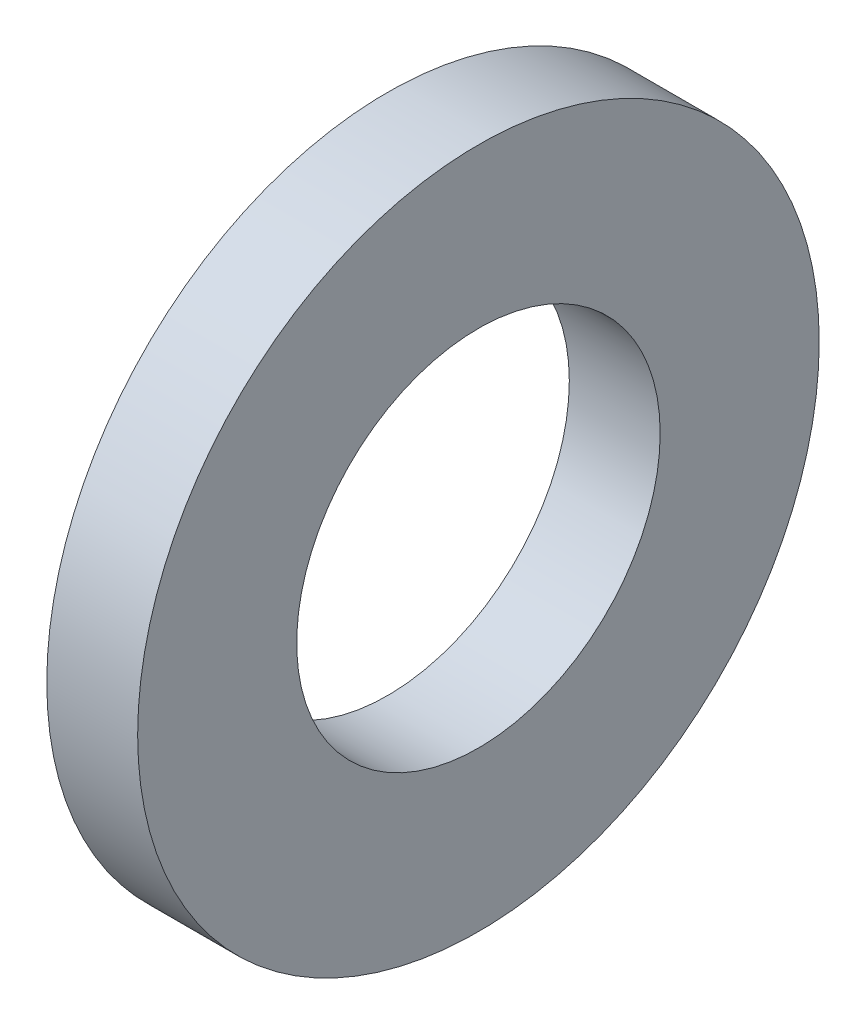
ISO-10303-21;
HEADER;
FILE_DESCRIPTION(('STEP AP214'),'2;1');
FILE_NAME('part.step','',(''),(''),'','','');
FILE_SCHEMA(('AUTOMOTIVE_DESIGN { 1 0 10303 214 1 1 1 1 }'));
ENDSEC;
DATA;
#1=APPLICATION_CONTEXT('core data for automotive mechanical design processes');
#2=APPLICATION_PROTOCOL_DEFINITION('international standard','automotive_design',2000,#1);
#3=PRODUCT_CONTEXT('',#1,'mechanical');
#4=PRODUCT('Part','Part','',(#3));
#5=PRODUCT_RELATED_PRODUCT_CATEGORY('part','',(#4));
#6=PRODUCT_DEFINITION_FORMATION('','',#4);
#7=PRODUCT_DEFINITION_CONTEXT('part definition',#1,'design');
#8=PRODUCT_DEFINITION('design','',#6,#7);
#9=PRODUCT_DEFINITION_SHAPE('','',#8);
#10=(LENGTH_UNIT() NAMED_UNIT(*) SI_UNIT(.MILLI.,.METRE.));
#11=(NAMED_UNIT(*) PLANE_ANGLE_UNIT() SI_UNIT($,.RADIAN.));
#12=(NAMED_UNIT(*) SI_UNIT($,.STERADIAN.) SOLID_ANGLE_UNIT());
#13=UNCERTAINTY_MEASURE_WITH_UNIT(LENGTH_MEASURE(1.E-05),#10,'distance_accuracy_value','');
#14=(GEOMETRIC_REPRESENTATION_CONTEXT(3) GLOBAL_UNCERTAINTY_ASSIGNED_CONTEXT((#13)) GLOBAL_UNIT_ASSIGNED_CONTEXT((#10,
#11,#12)) REPRESENTATION_CONTEXT('',''));
#15=CARTESIAN_POINT('',(0.,0.,0.));
#16=DIRECTION('',(0.,0.,1.));
#17=DIRECTION('',(1.,0.,0.));
#18=AXIS2_PLACEMENT_3D('',#15,#16,#17);
#19=CARTESIAN_POINT('',(0.,0.,0.));
#20=DIRECTION('',(-1.,0.,0.));
#21=DIRECTION('',(0.,0.,1.));
#22=AXIS2_PLACEMENT_3D('',#19,#20,#21);
#23=PLANE('',#22);
#24=CARTESIAN_POINT('',(0.,0.,0.));
#25=DIRECTION('',(1.,0.,0.));
#26=DIRECTION('',(0.,0.,-1.));
#27=AXIS2_PLACEMENT_3D('',#24,#25,#26);
#28=CIRCLE('',#27,3.2);
#29=CARTESIAN_POINT('',(0.,0.,-3.2));
#30=VERTEX_POINT('',#29);
#31=EDGE_CURVE('E30',#30,#30,#28,.T.);
#32=ORIENTED_EDGE('',*,*,#31,.T.);
#33=EDGE_LOOP('',(#32));
#34=FACE_BOUND('',#33,.T.);
#35=CARTESIAN_POINT('',(0.,0.,0.));
#36=DIRECTION('',(1.,0.,0.));
#37=DIRECTION('',(0.,0.,-1.));
#38=AXIS2_PLACEMENT_3D('',#35,#36,#37);
#39=CIRCLE('',#38,6.);
#40=CARTESIAN_POINT('',(0.,0.,-6.));
#41=VERTEX_POINT('',#40);
#42=EDGE_CURVE('E17',#41,#41,#39,.T.);
#43=ORIENTED_EDGE('',*,*,#42,.F.);
#44=EDGE_LOOP('',(#43));
#45=FACE_BOUND('',#44,.T.);
#46=ADVANCED_FACE('F14',(#34,#45),#23,.T.);
#47=CARTESIAN_POINT('',(0.,0.,0.));
#48=DIRECTION('',(1.,0.,0.));
#49=DIRECTION('',(0.,0.,-1.));
#50=AXIS2_PLACEMENT_3D('',#47,#48,#49);
#51=CYLINDRICAL_SURFACE('',#50,6.);
#52=ORIENTED_EDGE('',*,*,#42,.T.);
#53=EDGE_LOOP('',(#52));
#54=FACE_BOUND('',#53,.T.);
#55=CARTESIAN_POINT('',(1.6,0.,0.));
#56=DIRECTION('',(1.,0.,0.));
#57=DIRECTION('',(0.,0.,-1.));
#58=AXIS2_PLACEMENT_3D('',#55,#56,#57);
#59=CIRCLE('',#58,6.);
#60=CARTESIAN_POINT('',(1.6,0.,-6.));
#61=VERTEX_POINT('',#60);
#62=EDGE_CURVE('E22',#61,#61,#59,.F.);
#63=ORIENTED_EDGE('',*,*,#62,.T.);
#64=EDGE_LOOP('',(#63));
#65=FACE_BOUND('',#64,.T.);
#66=ADVANCED_FACE('F38',(#54,#65),#51,.T.);
#67=CARTESIAN_POINT('',(0.,0.,0.));
#68=DIRECTION('',(1.,0.,0.));
#69=DIRECTION('',(0.,0.,-1.));
#70=AXIS2_PLACEMENT_3D('',#67,#68,#69);
#71=CYLINDRICAL_SURFACE('',#70,3.2);
#72=ORIENTED_EDGE('',*,*,#31,.F.);
#73=EDGE_LOOP('',(#72));
#74=FACE_BOUND('',#73,.T.);
#75=CARTESIAN_POINT('',(1.6,0.,0.));
#76=DIRECTION('',(1.,0.,0.));
#77=DIRECTION('',(0.,0.,-1.));
#78=AXIS2_PLACEMENT_3D('',#75,#76,#77);
#79=CIRCLE('',#78,3.2);
#80=CARTESIAN_POINT('',(1.6,0.,-3.2));
#81=VERTEX_POINT('',#80);
#82=EDGE_CURVE('E10',#81,#81,#79,.T.);
#83=ORIENTED_EDGE('',*,*,#82,.T.);
#84=EDGE_LOOP('',(#83));
#85=FACE_BOUND('',#84,.T.);
#86=ADVANCED_FACE('F46',(#74,#85),#71,.F.);
#87=CARTESIAN_POINT('',(1.6,0.,0.));
#88=DIRECTION('',(-1.,0.,0.));
#89=DIRECTION('',(0.,0.,1.));
#90=AXIS2_PLACEMENT_3D('',#87,#88,#89);
#91=PLANE('',#90);
#92=ORIENTED_EDGE('',*,*,#82,.F.);
#93=EDGE_LOOP('',(#92));
#94=FACE_BOUND('',#93,.T.);
#95=ORIENTED_EDGE('',*,*,#62,.F.);
#96=EDGE_LOOP('',(#95));
#97=FACE_BOUND('',#96,.T.);
#98=ADVANCED_FACE('F47',(#94,#97),#91,.F.);
#99=CLOSED_SHELL('',(#46,#66,#86,#98));
#100=MANIFOLD_SOLID_BREP('B1',#99);
#101=ADVANCED_BREP_SHAPE_REPRESENTATION('',(#18,#100),#14);
#102=SHAPE_DEFINITION_REPRESENTATION(#9,#101);
ENDSEC;
END-ISO-10303-21;
